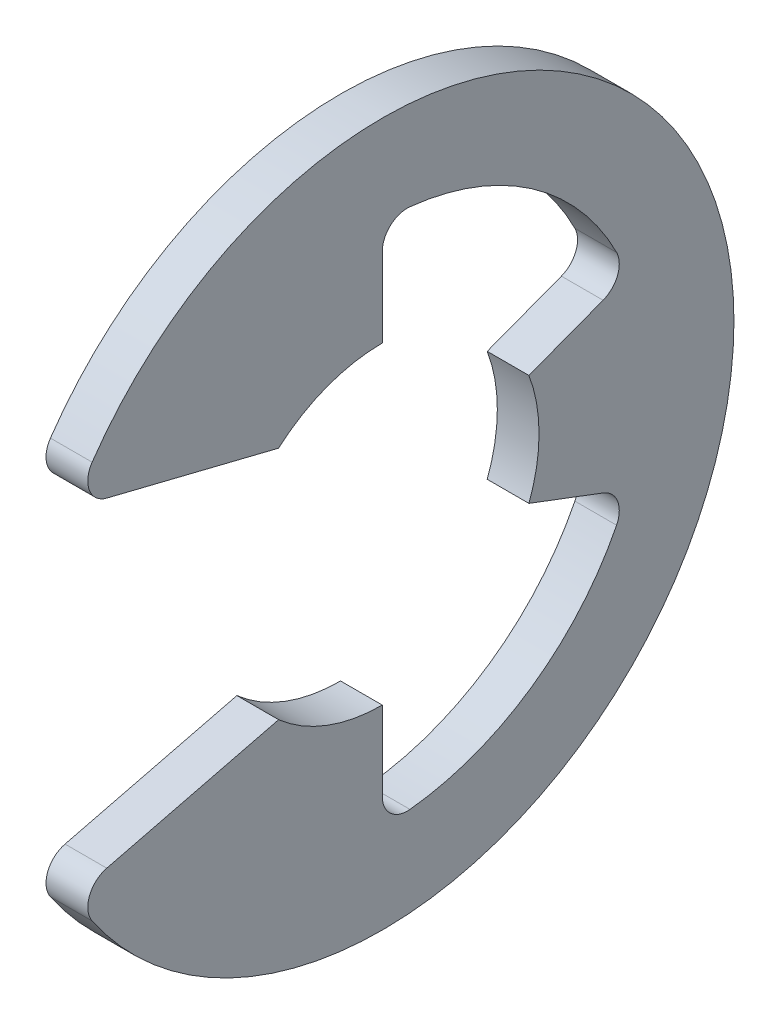
ISO-10303-21;
HEADER;
FILE_DESCRIPTION(('STEP AP214'),'2;1');
FILE_NAME('part.step','',(''),(''),'','','');
FILE_SCHEMA(('AUTOMOTIVE_DESIGN { 1 0 10303 214 1 1 1 1 }'));
ENDSEC;
DATA;
#1=APPLICATION_CONTEXT('core data for automotive mechanical design processes');
#2=APPLICATION_PROTOCOL_DEFINITION('international standard','automotive_design',2000,#1);
#3=PRODUCT_CONTEXT('',#1,'mechanical');
#4=PRODUCT('Part','Part','',(#3));
#5=PRODUCT_RELATED_PRODUCT_CATEGORY('part','',(#4));
#6=PRODUCT_DEFINITION_FORMATION('','',#4);
#7=PRODUCT_DEFINITION_CONTEXT('part definition',#1,'design');
#8=PRODUCT_DEFINITION('design','',#6,#7);
#9=PRODUCT_DEFINITION_SHAPE('','',#8);
#10=(LENGTH_UNIT() NAMED_UNIT(*) SI_UNIT(.MILLI.,.METRE.));
#11=(NAMED_UNIT(*) PLANE_ANGLE_UNIT() SI_UNIT($,.RADIAN.));
#12=(NAMED_UNIT(*) SI_UNIT($,.STERADIAN.) SOLID_ANGLE_UNIT());
#13=UNCERTAINTY_MEASURE_WITH_UNIT(LENGTH_MEASURE(1.E-05),#10,'distance_accuracy_value','');
#14=(GEOMETRIC_REPRESENTATION_CONTEXT(3) GLOBAL_UNCERTAINTY_ASSIGNED_CONTEXT((#13)) GLOBAL_UNIT_ASSIGNED_CONTEXT((#10,
#11,#12)) REPRESENTATION_CONTEXT('',''));
#15=CARTESIAN_POINT('',(0.,0.,0.));
#16=DIRECTION('',(0.,0.,1.));
#17=DIRECTION('',(1.,0.,0.));
#18=AXIS2_PLACEMENT_3D('',#15,#16,#17);
#19=CARTESIAN_POINT('',(0.35,0.,0.));
#20=DIRECTION('',(-1.,0.,0.));
#21=DIRECTION('',(0.,0.,1.));
#22=AXIS2_PLACEMENT_3D('',#19,#20,#21);
#23=CYLINDRICAL_SURFACE('',#22,5.9);
#24=CARTESIAN_POINT('',(0.35,0.,0.));
#25=DIRECTION('',(1.,0.,0.));
#26=DIRECTION('',(0.,0.,-1.));
#27=AXIS2_PLACEMENT_3D('',#24,#25,#26);
#28=CIRCLE('',#27,5.9);
#29=CARTESIAN_POINT('',(0.35,-3.33323303264902,4.86821913537768));
#30=VERTEX_POINT('',#29);
#31=CARTESIAN_POINT('',(0.35,3.33323303264902,4.86821913537768));
#32=VERTEX_POINT('',#31);
#33=EDGE_CURVE('E172',#30,#32,#28,.T.);
#34=ORIENTED_EDGE('',*,*,#33,.F.);
#35=DIRECTION('',(-1.,0.,0.));
#36=VECTOR('',#35,1.);
#37=CARTESIAN_POINT('',(0.35,-3.33323303264902,4.86821913537768));
#38=LINE('',#37,#36);
#39=CARTESIAN_POINT('',(-0.35,-3.33323303264902,4.86821913537768));
#40=VERTEX_POINT('',#39);
#41=EDGE_CURVE('E266',#30,#40,#38,.T.);
#42=ORIENTED_EDGE('',*,*,#41,.T.);
#43=CARTESIAN_POINT('',(-0.35,0.,0.));
#44=DIRECTION('',(1.,0.,0.));
#45=DIRECTION('',(0.,0.,-1.));
#46=AXIS2_PLACEMENT_3D('',#43,#44,#45);
#47=CIRCLE('',#46,5.9);
#48=CARTESIAN_POINT('',(-0.35,3.33323303264902,4.86821913537768));
#49=VERTEX_POINT('',#48);
#50=EDGE_CURVE('E210',#40,#49,#47,.T.);
#51=ORIENTED_EDGE('',*,*,#50,.T.);
#52=DIRECTION('',(-1.,0.,0.));
#53=VECTOR('',#52,1.);
#54=CARTESIAN_POINT('',(0.35,3.33323303264902,4.86821913537768));
#55=LINE('',#54,#53);
#56=EDGE_CURVE('E264',#49,#32,#55,.F.);
#57=ORIENTED_EDGE('',*,*,#56,.T.);
#58=EDGE_LOOP('',(#34,#42,#51,#57));
#59=FACE_BOUND('',#58,.T.);
#60=ADVANCED_FACE('F34',(#59),#23,.T.);
#61=CARTESIAN_POINT('',(0.35,2.82638434535392,5.17895274474852));
#62=DIRECTION('',(0.,0.970536829925373,-0.240952820606873));
#63=DIRECTION('',(0.,0.240952820606873,0.970536829925373));
#64=AXIS2_PLACEMENT_3D('',#61,#62,#63);
#65=PLANE('',#64);
#66=DIRECTION('',(0.,-0.240952820606873,-0.970536829925373));
#67=VECTOR('',#66,1.);
#68=CARTESIAN_POINT('',(0.35,2.82638434535392,5.17895274474852));
#69=LINE('',#68,#67);
#70=CARTESIAN_POINT('',(0.35,2.68832656853585,4.62286812734467));
#71=VERTEX_POINT('',#70);
#72=CARTESIAN_POINT('',(0.35,1.9725,1.73958148702497));
#73=VERTEX_POINT('',#72);
#74=EDGE_CURVE('E158',#71,#73,#69,.T.);
#75=ORIENTED_EDGE('',*,*,#74,.F.);
#76=DIRECTION('',(-1.,0.,0.));
#77=VECTOR('',#76,1.);
#78=CARTESIAN_POINT('',(0.35,2.68832656853585,4.62286812734467));
#79=LINE('',#78,#77);
#80=CARTESIAN_POINT('',(-0.35,2.68832656853585,4.62286812734467));
#81=VERTEX_POINT('',#80);
#82=EDGE_CURVE('E278',#71,#81,#79,.T.);
#83=ORIENTED_EDGE('',*,*,#82,.T.);
#84=DIRECTION('',(0.,-0.240952820606873,-0.970536829925373));
#85=VECTOR('',#84,1.);
#86=CARTESIAN_POINT('',(-0.35,2.82638434535392,5.17895274474852));
#87=LINE('',#86,#85);
#88=CARTESIAN_POINT('',(-0.35,1.9725,1.73958148702497));
#89=VERTEX_POINT('',#88);
#90=EDGE_CURVE('E178',#81,#89,#87,.T.);
#91=ORIENTED_EDGE('',*,*,#90,.T.);
#92=DIRECTION('',(-1.,0.,0.));
#93=VECTOR('',#92,1.);
#94=CARTESIAN_POINT('',(0.35,1.9725,1.73958148702497));
#95=LINE('',#94,#93);
#96=EDGE_CURVE('E175',#73,#89,#95,.T.);
#97=ORIENTED_EDGE('',*,*,#96,.F.);
#98=EDGE_LOOP('',(#75,#83,#91,#97));
#99=FACE_BOUND('',#98,.T.);
#100=ADVANCED_FACE('F176',(#99),#65,.F.);
#101=CARTESIAN_POINT('',(0.35,0.,0.));
#102=DIRECTION('',(-1.,0.,0.));
#103=DIRECTION('',(0.,0.,1.));
#104=AXIS2_PLACEMENT_3D('',#101,#102,#103);
#105=CYLINDRICAL_SURFACE('',#104,2.63);
#106=CARTESIAN_POINT('',(-0.35,0.,0.));
#107=DIRECTION('',(-1.,0.,0.));
#108=DIRECTION('',(0.,0.,1.));
#109=AXIS2_PLACEMENT_3D('',#106,#107,#108);
#110=CIRCLE('',#109,2.63);
#111=CARTESIAN_POINT('',(-0.35,2.63,0.));
#112=VERTEX_POINT('',#111);
#113=EDGE_CURVE('E214',#89,#112,#110,.T.);
#114=ORIENTED_EDGE('',*,*,#113,.T.);
#115=DIRECTION('',(-1.,0.,0.));
#116=VECTOR('',#115,1.);
#117=CARTESIAN_POINT('',(0.35,2.63,0.));
#118=LINE('',#117,#116);
#119=CARTESIAN_POINT('',(0.35,2.63,0.));
#120=VERTEX_POINT('',#119);
#121=EDGE_CURVE('E182',#120,#112,#118,.T.);
#122=ORIENTED_EDGE('',*,*,#121,.F.);
#123=CARTESIAN_POINT('',(0.35,0.,0.));
#124=DIRECTION('',(-1.,0.,0.));
#125=DIRECTION('',(0.,0.,1.));
#126=AXIS2_PLACEMENT_3D('',#123,#124,#125);
#127=CIRCLE('',#126,2.63);
#128=EDGE_CURVE('E164',#73,#120,#127,.T.);
#129=ORIENTED_EDGE('',*,*,#128,.F.);
#130=ORIENTED_EDGE('',*,*,#96,.T.);
#131=EDGE_LOOP('',(#114,#122,#129,#130));
#132=FACE_BOUND('',#131,.T.);
#133=ADVANCED_FACE('F184',(#132),#105,.F.);
#134=CARTESIAN_POINT('',(0.35,2.63,0.));
#135=DIRECTION('',(0.,0.,1.));
#136=DIRECTION('',(0.,-1.,0.));
#137=AXIS2_PLACEMENT_3D('',#134,#135,#136);
#138=PLANE('',#137);
#139=DIRECTION('',(0.,1.,0.));
#140=VECTOR('',#139,1.);
#141=CARTESIAN_POINT('',(-0.35,2.63,0.));
#142=LINE('',#141,#140);
#143=CARTESIAN_POINT('',(-0.35,3.96037227987639,0.));
#144=VERTEX_POINT('',#143);
#145=EDGE_CURVE('E216',#112,#144,#142,.T.);
#146=ORIENTED_EDGE('',*,*,#145,.T.);
#147=DIRECTION('',(1.,0.,0.));
#148=VECTOR('',#147,1.);
#149=CARTESIAN_POINT('',(0.35,3.96037227987639,0.));
#150=LINE('',#149,#148);
#151=CARTESIAN_POINT('',(0.35,3.96037227987639,0.));
#152=VERTEX_POINT('',#151);
#153=EDGE_CURVE('E262',#144,#152,#150,.T.);
#154=ORIENTED_EDGE('',*,*,#153,.T.);
#155=DIRECTION('',(0.,1.,0.));
#156=VECTOR('',#155,1.);
#157=CARTESIAN_POINT('',(0.35,2.63,0.));
#158=LINE('',#157,#156);
#159=EDGE_CURVE('E187',#120,#152,#158,.T.);
#160=ORIENTED_EDGE('',*,*,#159,.F.);
#161=ORIENTED_EDGE('',*,*,#121,.T.);
#162=EDGE_LOOP('',(#146,#154,#160,#161));
#163=FACE_BOUND('',#162,.T.);
#164=ADVANCED_FACE('F384',(#163),#138,.F.);
#165=CARTESIAN_POINT('',(0.35,0.,0.));
#166=DIRECTION('',(-1.,0.,0.));
#167=DIRECTION('',(0.,0.,1.));
#168=AXIS2_PLACEMENT_3D('',#165,#166,#167);
#169=CYLINDRICAL_SURFACE('',#168,4.40258064516129);
#170=CARTESIAN_POINT('',(0.35,0.,0.));
#171=DIRECTION('',(-1.,0.,0.));
#172=DIRECTION('',(0.,0.,-1.));
#173=AXIS2_PLACEMENT_3D('',#170,#171,#172);
#174=CIRCLE('',#173,4.40258064516129);
#175=CARTESIAN_POINT('',(0.35,4.37803020215074,-0.4642928883849));
#176=VERTEX_POINT('',#175);
#177=CARTESIAN_POINT('',(0.35,1.98217365095315,-3.93111993643235));
#178=VERTEX_POINT('',#177);
#179=EDGE_CURVE('E189',#176,#178,#174,.T.);
#180=ORIENTED_EDGE('',*,*,#179,.F.);
#181=DIRECTION('',(-1.,0.,0.));
#182=VECTOR('',#181,1.);
#183=CARTESIAN_POINT('',(0.35,4.37803020215074,-0.4642928883849));
#184=LINE('',#183,#182);
#185=CARTESIAN_POINT('',(-0.35,4.37803020215074,-0.4642928883849));
#186=VERTEX_POINT('',#185);
#187=EDGE_CURVE('E259',#176,#186,#184,.T.);
#188=ORIENTED_EDGE('',*,*,#187,.T.);
#189=CARTESIAN_POINT('',(-0.35,0.,0.));
#190=DIRECTION('',(-1.,0.,0.));
#191=DIRECTION('',(0.,0.,-1.));
#192=AXIS2_PLACEMENT_3D('',#189,#190,#191);
#193=CIRCLE('',#192,4.40258064516129);
#194=CARTESIAN_POINT('',(-0.35,1.98217365095315,-3.93111993643235));
#195=VERTEX_POINT('',#194);
#196=EDGE_CURVE('E219',#186,#195,#193,.T.);
#197=ORIENTED_EDGE('',*,*,#196,.T.);
#198=DIRECTION('',(-1.,0.,0.));
#199=VECTOR('',#198,1.);
#200=CARTESIAN_POINT('',(0.35,1.98217365095315,-3.93111993643235));
#201=LINE('',#200,#199);
#202=EDGE_CURVE('E257',#195,#178,#201,.F.);
#203=ORIENTED_EDGE('',*,*,#202,.T.);
#204=EDGE_LOOP('',(#180,#188,#197,#203));
#205=FACE_BOUND('',#204,.T.);
#206=ADVANCED_FACE('F306',(#205),#169,.F.);
#207=CARTESIAN_POINT('',(0.35,0.92984541726031,-2.46013973180387));
#208=DIRECTION('',(0.,-0.935414346693484,-0.353553390593276));
#209=DIRECTION('',(0.,0.353553390593276,-0.935414346693485));
#210=AXIS2_PLACEMENT_3D('',#207,#208,#209);
#211=PLANE('',#210);
#212=DIRECTION('',(0.,-0.353553390593276,0.935414346693484));
#213=VECTOR('',#212,1.);
#214=CARTESIAN_POINT('',(0.35,0.92984541726031,-2.46013973180387));
#215=LINE('',#214,#213);
#216=CARTESIAN_POINT('',(0.35,1.40020304756192,-3.70458904884356));
#217=VERTEX_POINT('',#216);
#218=CARTESIAN_POINT('',(0.35,0.92984541726031,-2.46013973180387));
#219=VERTEX_POINT('',#218);
#220=EDGE_CURVE('E194',#217,#219,#215,.T.);
#221=ORIENTED_EDGE('',*,*,#220,.F.);
#222=DIRECTION('',(1.,0.,0.));
#223=VECTOR('',#222,1.);
#224=CARTESIAN_POINT('',(-0.35,1.40020304756192,-3.70458904884356));
#225=LINE('',#224,#223);
#226=CARTESIAN_POINT('',(-0.35,1.40020304756192,-3.70458904884356));
#227=VERTEX_POINT('',#226);
#228=EDGE_CURVE('E281',#217,#227,#225,.F.);
#229=ORIENTED_EDGE('',*,*,#228,.T.);
#230=DIRECTION('',(0.,-0.353553390593276,0.935414346693484));
#231=VECTOR('',#230,1.);
#232=CARTESIAN_POINT('',(-0.35,0.92984541726031,-2.46013973180387));
#233=LINE('',#232,#231);
#234=CARTESIAN_POINT('',(-0.35,0.92984541726031,-2.46013973180387));
#235=VERTEX_POINT('',#234);
#236=EDGE_CURVE('E222',#227,#235,#233,.T.);
#237=ORIENTED_EDGE('',*,*,#236,.T.);
#238=DIRECTION('',(-1.,0.,0.));
#239=VECTOR('',#238,1.);
#240=CARTESIAN_POINT('',(0.35,0.92984541726031,-2.46013973180387));
#241=LINE('',#240,#239);
#242=EDGE_CURVE('E246',#219,#235,#241,.T.);
#243=ORIENTED_EDGE('',*,*,#242,.F.);
#244=EDGE_LOOP('',(#221,#229,#237,#243));
#245=FACE_BOUND('',#244,.T.);
#246=ADVANCED_FACE('F309',(#245),#211,.F.);
#247=CARTESIAN_POINT('',(0.35,0.,0.));
#248=DIRECTION('',(-1.,0.,0.));
#249=DIRECTION('',(0.,0.,1.));
#250=AXIS2_PLACEMENT_3D('',#247,#248,#249);
#251=CYLINDRICAL_SURFACE('',#250,2.63);
#252=CARTESIAN_POINT('',(-0.35,0.,0.));
#253=DIRECTION('',(-1.,0.,0.));
#254=DIRECTION('',(0.,0.,1.));
#255=AXIS2_PLACEMENT_3D('',#252,#253,#254);
#256=CIRCLE('',#255,2.63);
#257=CARTESIAN_POINT('',(-0.35,-0.92984541726031,-2.46013973180387));
#258=VERTEX_POINT('',#257);
#259=EDGE_CURVE('E224',#235,#258,#256,.T.);
#260=ORIENTED_EDGE('',*,*,#259,.T.);
#261=DIRECTION('',(-1.,0.,0.));
#262=VECTOR('',#261,1.);
#263=CARTESIAN_POINT('',(0.35,-0.92984541726031,-2.46013973180387));
#264=LINE('',#263,#262);
#265=CARTESIAN_POINT('',(0.35,-0.92984541726031,-2.46013973180387));
#266=VERTEX_POINT('',#265);
#267=EDGE_CURVE('E243',#266,#258,#264,.T.);
#268=ORIENTED_EDGE('',*,*,#267,.F.);
#269=CARTESIAN_POINT('',(0.35,0.,0.));
#270=DIRECTION('',(-1.,0.,0.));
#271=DIRECTION('',(0.,0.,1.));
#272=AXIS2_PLACEMENT_3D('',#269,#270,#271);
#273=CIRCLE('',#272,2.63);
#274=EDGE_CURVE('E196',#219,#266,#273,.T.);
#275=ORIENTED_EDGE('',*,*,#274,.F.);
#276=ORIENTED_EDGE('',*,*,#242,.T.);
#277=EDGE_LOOP('',(#260,#268,#275,#276));
#278=FACE_BOUND('',#277,.T.);
#279=ADVANCED_FACE('F315',(#278),#251,.F.);
#280=CARTESIAN_POINT('',(0.35,-0.92984541726031,-2.46013973180387));
#281=DIRECTION('',(0.,0.935414346693485,-0.353553390593276));
#282=DIRECTION('',(0.,0.353553390593276,0.935414346693485));
#283=AXIS2_PLACEMENT_3D('',#280,#281,#282);
#284=PLANE('',#283);
#285=DIRECTION('',(0.,-0.353553390593276,-0.935414346693485));
#286=VECTOR('',#285,1.);
#287=CARTESIAN_POINT('',(-0.35,-0.92984541726031,-2.46013973180387));
#288=LINE('',#287,#286);
#289=CARTESIAN_POINT('',(-0.35,-1.40020304756192,-3.70458904884357));
#290=VERTEX_POINT('',#289);
#291=EDGE_CURVE('E226',#258,#290,#288,.T.);
#292=ORIENTED_EDGE('',*,*,#291,.T.);
#293=DIRECTION('',(1.,0.,0.));
#294=VECTOR('',#293,1.);
#295=CARTESIAN_POINT('',(0.35,-1.40020304756191,-3.70458904884357));
#296=LINE('',#295,#294);
#297=CARTESIAN_POINT('',(0.35,-1.40020304756192,-3.70458904884357));
#298=VERTEX_POINT('',#297);
#299=EDGE_CURVE('E49',#290,#298,#296,.T.);
#300=ORIENTED_EDGE('',*,*,#299,.T.);
#301=DIRECTION('',(0.,-0.353553390593276,-0.935414346693485));
#302=VECTOR('',#301,1.);
#303=CARTESIAN_POINT('',(0.35,-0.92984541726031,-2.46013973180387));
#304=LINE('',#303,#302);
#305=EDGE_CURVE('E198',#266,#298,#304,.T.);
#306=ORIENTED_EDGE('',*,*,#305,.F.);
#307=ORIENTED_EDGE('',*,*,#267,.T.);
#308=EDGE_LOOP('',(#292,#300,#306,#307));
#309=FACE_BOUND('',#308,.T.);
#310=ADVANCED_FACE('F317',(#309),#284,.F.);
#311=CARTESIAN_POINT('',(0.35,0.,0.));
#312=DIRECTION('',(-1.,0.,0.));
#313=DIRECTION('',(0.,0.,1.));
#314=AXIS2_PLACEMENT_3D('',#311,#312,#313);
#315=CYLINDRICAL_SURFACE('',#314,4.40258064516129);
#316=CARTESIAN_POINT('',(-0.35,0.,0.));
#317=DIRECTION('',(-1.,0.,0.));
#318=DIRECTION('',(0.,0.,-1.));
#319=AXIS2_PLACEMENT_3D('',#316,#317,#318);
#320=CIRCLE('',#319,4.40258064516129);
#321=CARTESIAN_POINT('',(-0.35,-1.98217365095315,-3.93111993643235));
#322=VERTEX_POINT('',#321);
#323=CARTESIAN_POINT('',(-0.35,-4.37803020215074,-0.464292888384901));
#324=VERTEX_POINT('',#323);
#325=EDGE_CURVE('E228',#322,#324,#320,.T.);
#326=ORIENTED_EDGE('',*,*,#325,.T.);
#327=DIRECTION('',(-1.,0.,0.));
#328=VECTOR('',#327,1.);
#329=CARTESIAN_POINT('',(0.35,-4.37803020215074,-0.464292888384901));
#330=LINE('',#329,#328);
#331=CARTESIAN_POINT('',(0.35,-4.37803020215074,-0.464292888384901));
#332=VERTEX_POINT('',#331);
#333=EDGE_CURVE('E255',#324,#332,#330,.F.);
#334=ORIENTED_EDGE('',*,*,#333,.T.);
#335=CARTESIAN_POINT('',(0.35,0.,0.));
#336=DIRECTION('',(-1.,0.,0.));
#337=DIRECTION('',(0.,0.,-1.));
#338=AXIS2_PLACEMENT_3D('',#335,#336,#337);
#339=CIRCLE('',#338,4.40258064516129);
#340=CARTESIAN_POINT('',(0.35,-1.98217365095315,-3.93111993643235));
#341=VERTEX_POINT('',#340);
#342=EDGE_CURVE('E200',#341,#332,#339,.T.);
#343=ORIENTED_EDGE('',*,*,#342,.F.);
#344=DIRECTION('',(-1.,0.,0.));
#345=VECTOR('',#344,1.);
#346=CARTESIAN_POINT('',(0.35,-1.98217365095315,-3.93111993643235));
#347=LINE('',#346,#345);
#348=EDGE_CURVE('E252',#341,#322,#347,.T.);
#349=ORIENTED_EDGE('',*,*,#348,.T.);
#350=EDGE_LOOP('',(#326,#334,#343,#349));
#351=FACE_BOUND('',#350,.T.);
#352=ADVANCED_FACE('F319',(#351),#315,.F.);
#353=CARTESIAN_POINT('',(0.35,-2.63,0.));
#354=DIRECTION('',(0.,0.,1.));
#355=DIRECTION('',(0.,-1.,0.));
#356=AXIS2_PLACEMENT_3D('',#353,#354,#355);
#357=PLANE('',#356);
#358=DIRECTION('',(0.,1.,0.));
#359=VECTOR('',#358,1.);
#360=CARTESIAN_POINT('',(0.35,-2.63,0.));
#361=LINE('',#360,#359);
#362=CARTESIAN_POINT('',(0.35,-3.96037227987639,0.));
#363=VERTEX_POINT('',#362);
#364=CARTESIAN_POINT('',(0.35,-2.63,0.));
#365=VERTEX_POINT('',#364);
#366=EDGE_CURVE('E203',#363,#365,#361,.T.);
#367=ORIENTED_EDGE('',*,*,#366,.F.);
#368=DIRECTION('',(1.,0.,0.));
#369=VECTOR('',#368,1.);
#370=CARTESIAN_POINT('',(-0.35,-3.96037227987639,0.));
#371=LINE('',#370,#369);
#372=CARTESIAN_POINT('',(-0.35,-3.96037227987639,0.));
#373=VERTEX_POINT('',#372);
#374=EDGE_CURVE('E181',#363,#373,#371,.F.);
#375=ORIENTED_EDGE('',*,*,#374,.T.);
#376=DIRECTION('',(0.,1.,0.));
#377=VECTOR('',#376,1.);
#378=CARTESIAN_POINT('',(-0.35,-2.63,0.));
#379=LINE('',#378,#377);
#380=CARTESIAN_POINT('',(-0.35,-2.63,0.));
#381=VERTEX_POINT('',#380);
#382=EDGE_CURVE('E231',#373,#381,#379,.T.);
#383=ORIENTED_EDGE('',*,*,#382,.T.);
#384=DIRECTION('',(-1.,0.,0.));
#385=VECTOR('',#384,1.);
#386=CARTESIAN_POINT('',(0.35,-2.63,0.));
#387=LINE('',#386,#385);
#388=EDGE_CURVE('E240',#365,#381,#387,.T.);
#389=ORIENTED_EDGE('',*,*,#388,.F.);
#390=EDGE_LOOP('',(#367,#375,#383,#389));
#391=FACE_BOUND('',#390,.T.);
#392=ADVANCED_FACE('F325',(#391),#357,.F.);
#393=CARTESIAN_POINT('',(0.35,0.,0.));
#394=DIRECTION('',(-1.,0.,0.));
#395=DIRECTION('',(0.,0.,1.));
#396=AXIS2_PLACEMENT_3D('',#393,#394,#395);
#397=CYLINDRICAL_SURFACE('',#396,2.63);
#398=CARTESIAN_POINT('',(-0.35,0.,0.));
#399=DIRECTION('',(-1.,0.,0.));
#400=DIRECTION('',(0.,0.,-1.));
#401=AXIS2_PLACEMENT_3D('',#398,#399,#400);
#402=CIRCLE('',#401,2.63);
#403=CARTESIAN_POINT('',(-0.35,-1.9725,1.73958148702497));
#404=VERTEX_POINT('',#403);
#405=EDGE_CURVE('E233',#381,#404,#402,.T.);
#406=ORIENTED_EDGE('',*,*,#405,.T.);
#407=DIRECTION('',(-1.,0.,0.));
#408=VECTOR('',#407,1.);
#409=CARTESIAN_POINT('',(0.35,-1.9725,1.73958148702497));
#410=LINE('',#409,#408);
#411=CARTESIAN_POINT('',(0.35,-1.9725,1.73958148702497));
#412=VERTEX_POINT('',#411);
#413=EDGE_CURVE('E209',#412,#404,#410,.T.);
#414=ORIENTED_EDGE('',*,*,#413,.F.);
#415=CARTESIAN_POINT('',(0.35,0.,0.));
#416=DIRECTION('',(-1.,0.,0.));
#417=DIRECTION('',(0.,0.,-1.));
#418=AXIS2_PLACEMENT_3D('',#415,#416,#417);
#419=CIRCLE('',#418,2.63);
#420=EDGE_CURVE('E205',#365,#412,#419,.T.);
#421=ORIENTED_EDGE('',*,*,#420,.F.);
#422=ORIENTED_EDGE('',*,*,#388,.T.);
#423=EDGE_LOOP('',(#406,#414,#421,#422));
#424=FACE_BOUND('',#423,.T.);
#425=ADVANCED_FACE('F374',(#424),#397,.F.);
#426=CARTESIAN_POINT('',(0.35,-2.82638434535392,5.17895274474852));
#427=DIRECTION('',(0.,-0.970536829925373,-0.240952820606873));
#428=DIRECTION('',(0.,0.240952820606873,-0.970536829925373));
#429=AXIS2_PLACEMENT_3D('',#426,#427,#428);
#430=PLANE('',#429);
#431=DIRECTION('',(0.,-0.240952820606873,0.970536829925373));
#432=VECTOR('',#431,1.);
#433=CARTESIAN_POINT('',(-0.35,-2.82638434535392,5.17895274474852));
#434=LINE('',#433,#432);
#435=CARTESIAN_POINT('',(-0.35,-2.68832656853585,4.62286812734467));
#436=VERTEX_POINT('',#435);
#437=EDGE_CURVE('E235',#404,#436,#434,.T.);
#438=ORIENTED_EDGE('',*,*,#437,.T.);
#439=DIRECTION('',(-1.,0.,0.));
#440=VECTOR('',#439,1.);
#441=CARTESIAN_POINT('',(0.35,-2.68832656853585,4.62286812734467));
#442=LINE('',#441,#440);
#443=CARTESIAN_POINT('',(0.35,-2.68832656853585,4.62286812734467));
#444=VERTEX_POINT('',#443);
#445=EDGE_CURVE('E273',#436,#444,#442,.F.);
#446=ORIENTED_EDGE('',*,*,#445,.T.);
#447=DIRECTION('',(0.,-0.240952820606873,0.970536829925373));
#448=VECTOR('',#447,1.);
#449=CARTESIAN_POINT('',(0.35,-2.82638434535392,5.17895274474852));
#450=LINE('',#449,#448);
#451=EDGE_CURVE('E207',#412,#444,#450,.T.);
#452=ORIENTED_EDGE('',*,*,#451,.F.);
#453=ORIENTED_EDGE('',*,*,#413,.T.);
#454=EDGE_LOOP('',(#438,#446,#452,#453));
#455=FACE_BOUND('',#454,.T.);
#456=ADVANCED_FACE('F416',(#455),#430,.F.);
#457=CARTESIAN_POINT('',(0.35,0.,0.));
#458=DIRECTION('',(1.,0.,0.));
#459=DIRECTION('',(0.,0.,-1.));
#460=AXIS2_PLACEMENT_3D('',#457,#458,#459);
#461=PLANE('',#460);
#462=ORIENTED_EDGE('',*,*,#451,.T.);
#463=CARTESIAN_POINT('',(0.35,-3.09595203710451,4.52166794268978));
#464=DIRECTION('',(1.,0.,0.));
#465=DIRECTION('',(0.,0.,-1.));
#466=AXIS2_PLACEMENT_3D('',#463,#464,#465);
#467=CIRCLE('',#466,0.42);
#468=EDGE_CURVE('E276',#444,#30,#467,.T.);
#469=ORIENTED_EDGE('',*,*,#468,.T.);
#470=ORIENTED_EDGE('',*,*,#33,.T.);
#471=CARTESIAN_POINT('',(0.35,3.09595203710451,4.52166794268978));
#472=DIRECTION('',(1.,0.,0.));
#473=DIRECTION('',(0.,0.,-1.));
#474=AXIS2_PLACEMENT_3D('',#471,#472,#473);
#475=CIRCLE('',#474,0.42);
#476=EDGE_CURVE('E168',#32,#71,#475,.T.);
#477=ORIENTED_EDGE('',*,*,#476,.T.);
#478=ORIENTED_EDGE('',*,*,#74,.T.);
#479=ORIENTED_EDGE('',*,*,#128,.T.);
#480=ORIENTED_EDGE('',*,*,#159,.T.);
#481=CARTESIAN_POINT('',(0.35,3.96037227987639,-0.419999999999998));
#482=DIRECTION('',(1.,0.,0.));
#483=DIRECTION('',(0.,0.,-1.));
#484=AXIS2_PLACEMENT_3D('',#481,#482,#483);
#485=CIRCLE('',#484,0.42);
#486=EDGE_CURVE('E290',#152,#176,#485,.F.);
#487=ORIENTED_EDGE('',*,*,#486,.T.);
#488=ORIENTED_EDGE('',*,*,#179,.T.);
#489=CARTESIAN_POINT('',(0.35,1.79307707317318,-3.55609662479439));
#490=DIRECTION('',(1.,0.,0.));
#491=DIRECTION('',(0.,0.,-1.));
#492=AXIS2_PLACEMENT_3D('',#489,#490,#491);
#493=CIRCLE('',#492,0.42);
#494=EDGE_CURVE('E11',#178,#217,#493,.F.);
#495=ORIENTED_EDGE('',*,*,#494,.T.);
#496=ORIENTED_EDGE('',*,*,#220,.T.);
#497=ORIENTED_EDGE('',*,*,#274,.T.);
#498=ORIENTED_EDGE('',*,*,#305,.T.);
#499=CARTESIAN_POINT('',(0.35,-1.79307707317318,-3.55609662479439));
#500=DIRECTION('',(1.,0.,0.));
#501=DIRECTION('',(0.,0.,-1.));
#502=AXIS2_PLACEMENT_3D('',#499,#500,#501);
#503=CIRCLE('',#502,0.42);
#504=EDGE_CURVE('E294',#298,#341,#503,.F.);
#505=ORIENTED_EDGE('',*,*,#504,.T.);
#506=ORIENTED_EDGE('',*,*,#342,.T.);
#507=CARTESIAN_POINT('',(0.35,-3.96037227987639,-0.419999999999999));
#508=DIRECTION('',(1.,0.,0.));
#509=DIRECTION('',(0.,0.,-1.));
#510=AXIS2_PLACEMENT_3D('',#507,#508,#509);
#511=CIRCLE('',#510,0.42);
#512=EDGE_CURVE('E286',#332,#363,#511,.F.);
#513=ORIENTED_EDGE('',*,*,#512,.T.);
#514=ORIENTED_EDGE('',*,*,#366,.T.);
#515=ORIENTED_EDGE('',*,*,#420,.T.);
#516=EDGE_LOOP('',(#462,#469,#470,#477,#478,#479,#480,#487,#488,#495,#496,#497,#498,#505,#506,
#513,#514,#515));
#517=FACE_BOUND('',#516,.T.);
#518=ADVANCED_FACE('F161',(#517),#461,.T.);
#519=CARTESIAN_POINT('',(-0.35,0.,0.));
#520=DIRECTION('',(1.,0.,0.));
#521=DIRECTION('',(0.,0.,-1.));
#522=AXIS2_PLACEMENT_3D('',#519,#520,#521);
#523=PLANE('',#522);
#524=ORIENTED_EDGE('',*,*,#50,.F.);
#525=CARTESIAN_POINT('',(-0.35,-3.09595203710451,4.52166794268978));
#526=DIRECTION('',(1.,0.,0.));
#527=DIRECTION('',(0.,0.,-1.));
#528=AXIS2_PLACEMENT_3D('',#525,#526,#527);
#529=CIRCLE('',#528,0.42);
#530=EDGE_CURVE('E271',#40,#436,#529,.F.);
#531=ORIENTED_EDGE('',*,*,#530,.T.);
#532=ORIENTED_EDGE('',*,*,#437,.F.);
#533=ORIENTED_EDGE('',*,*,#405,.F.);
#534=ORIENTED_EDGE('',*,*,#382,.F.);
#535=CARTESIAN_POINT('',(-0.35,-3.96037227987639,-0.419999999999999));
#536=DIRECTION('',(1.,0.,0.));
#537=DIRECTION('',(0.,0.,-1.));
#538=AXIS2_PLACEMENT_3D('',#535,#536,#537);
#539=CIRCLE('',#538,0.42);
#540=EDGE_CURVE('E284',#373,#324,#539,.T.);
#541=ORIENTED_EDGE('',*,*,#540,.T.);
#542=ORIENTED_EDGE('',*,*,#325,.F.);
#543=CARTESIAN_POINT('',(-0.35,-1.79307707317318,-3.55609662479439));
#544=DIRECTION('',(1.,0.,0.));
#545=DIRECTION('',(0.,0.,-1.));
#546=AXIS2_PLACEMENT_3D('',#543,#544,#545);
#547=CIRCLE('',#546,0.42);
#548=EDGE_CURVE('E292',#322,#290,#547,.T.);
#549=ORIENTED_EDGE('',*,*,#548,.T.);
#550=ORIENTED_EDGE('',*,*,#291,.F.);
#551=ORIENTED_EDGE('',*,*,#259,.F.);
#552=ORIENTED_EDGE('',*,*,#236,.F.);
#553=CARTESIAN_POINT('',(-0.35,1.79307707317318,-3.55609662479439));
#554=DIRECTION('',(1.,0.,0.));
#555=DIRECTION('',(0.,0.,-1.));
#556=AXIS2_PLACEMENT_3D('',#553,#554,#555);
#557=CIRCLE('',#556,0.42);
#558=EDGE_CURVE('E42',#227,#195,#557,.T.);
#559=ORIENTED_EDGE('',*,*,#558,.T.);
#560=ORIENTED_EDGE('',*,*,#196,.F.);
#561=CARTESIAN_POINT('',(-0.35,3.96037227987639,-0.419999999999998));
#562=DIRECTION('',(1.,0.,0.));
#563=DIRECTION('',(0.,0.,-1.));
#564=AXIS2_PLACEMENT_3D('',#561,#562,#563);
#565=CIRCLE('',#564,0.42);
#566=EDGE_CURVE('E288',#186,#144,#565,.T.);
#567=ORIENTED_EDGE('',*,*,#566,.T.);
#568=ORIENTED_EDGE('',*,*,#145,.F.);
#569=ORIENTED_EDGE('',*,*,#113,.F.);
#570=ORIENTED_EDGE('',*,*,#90,.F.);
#571=CARTESIAN_POINT('',(-0.35,3.09595203710451,4.52166794268978));
#572=DIRECTION('',(1.,0.,0.));
#573=DIRECTION('',(0.,0.,-1.));
#574=AXIS2_PLACEMENT_3D('',#571,#572,#573);
#575=CIRCLE('',#574,0.42);
#576=EDGE_CURVE('E269',#81,#49,#575,.F.);
#577=ORIENTED_EDGE('',*,*,#576,.T.);
#578=EDGE_LOOP('',(#524,#531,#532,#533,#534,#541,#542,#549,#550,#551,#552,#559,#560,#567,#568,
#569,#570,#577));
#579=FACE_BOUND('',#578,.T.);
#580=ADVANCED_FACE('F299',(#579),#523,.F.);
#581=CARTESIAN_POINT('',(0.35,-3.96037227987639,-0.419999999999999));
#582=DIRECTION('',(-1.,0.,0.));
#583=DIRECTION('',(0.,0.,1.));
#584=AXIS2_PLACEMENT_3D('',#581,#582,#583);
#585=CYLINDRICAL_SURFACE('',#584,0.42);
#586=ORIENTED_EDGE('',*,*,#512,.F.);
#587=ORIENTED_EDGE('',*,*,#333,.F.);
#588=ORIENTED_EDGE('',*,*,#540,.F.);
#589=ORIENTED_EDGE('',*,*,#374,.F.);
#590=EDGE_LOOP('',(#586,#587,#588,#589));
#591=FACE_BOUND('',#590,.T.);
#592=ADVANCED_FACE('F339',(#591),#585,.F.);
#593=CARTESIAN_POINT('',(0.35,3.96037227987639,-0.419999999999998));
#594=DIRECTION('',(-1.,0.,0.));
#595=DIRECTION('',(0.,0.,1.));
#596=AXIS2_PLACEMENT_3D('',#593,#594,#595);
#597=CYLINDRICAL_SURFACE('',#596,0.42);
#598=ORIENTED_EDGE('',*,*,#486,.F.);
#599=ORIENTED_EDGE('',*,*,#153,.F.);
#600=ORIENTED_EDGE('',*,*,#566,.F.);
#601=ORIENTED_EDGE('',*,*,#187,.F.);
#602=EDGE_LOOP('',(#598,#599,#600,#601));
#603=FACE_BOUND('',#602,.T.);
#604=ADVANCED_FACE('F342',(#603),#597,.F.);
#605=CARTESIAN_POINT('',(0.35,-3.09595203710451,4.52166794268978));
#606=DIRECTION('',(-1.,0.,0.));
#607=DIRECTION('',(0.,0.,1.));
#608=AXIS2_PLACEMENT_3D('',#605,#606,#607);
#609=CYLINDRICAL_SURFACE('',#608,0.42);
#610=ORIENTED_EDGE('',*,*,#468,.F.);
#611=ORIENTED_EDGE('',*,*,#445,.F.);
#612=ORIENTED_EDGE('',*,*,#530,.F.);
#613=ORIENTED_EDGE('',*,*,#41,.F.);
#614=EDGE_LOOP('',(#610,#611,#612,#613));
#615=FACE_BOUND('',#614,.T.);
#616=ADVANCED_FACE('F346',(#615),#609,.T.);
#617=CARTESIAN_POINT('',(0.35,3.09595203710451,4.52166794268978));
#618=DIRECTION('',(-1.,0.,0.));
#619=DIRECTION('',(0.,0.,1.));
#620=AXIS2_PLACEMENT_3D('',#617,#618,#619);
#621=CYLINDRICAL_SURFACE('',#620,0.42);
#622=ORIENTED_EDGE('',*,*,#476,.F.);
#623=ORIENTED_EDGE('',*,*,#56,.F.);
#624=ORIENTED_EDGE('',*,*,#576,.F.);
#625=ORIENTED_EDGE('',*,*,#82,.F.);
#626=EDGE_LOOP('',(#622,#623,#624,#625));
#627=FACE_BOUND('',#626,.T.);
#628=ADVANCED_FACE('F350',(#627),#621,.T.);
#629=CARTESIAN_POINT('',(0.35,-1.79307707317318,-3.55609662479439));
#630=DIRECTION('',(-1.,0.,0.));
#631=DIRECTION('',(0.,0.,1.));
#632=AXIS2_PLACEMENT_3D('',#629,#630,#631);
#633=CYLINDRICAL_SURFACE('',#632,0.42);
#634=ORIENTED_EDGE('',*,*,#504,.F.);
#635=ORIENTED_EDGE('',*,*,#299,.F.);
#636=ORIENTED_EDGE('',*,*,#548,.F.);
#637=ORIENTED_EDGE('',*,*,#348,.F.);
#638=EDGE_LOOP('',(#634,#635,#636,#637));
#639=FACE_BOUND('',#638,.T.);
#640=ADVANCED_FACE('F353',(#639),#633,.F.);
#641=CARTESIAN_POINT('',(0.35,1.79307707317318,-3.55609662479439));
#642=DIRECTION('',(-1.,0.,0.));
#643=DIRECTION('',(0.,0.,1.));
#644=AXIS2_PLACEMENT_3D('',#641,#642,#643);
#645=CYLINDRICAL_SURFACE('',#644,0.42);
#646=ORIENTED_EDGE('',*,*,#494,.F.);
#647=ORIENTED_EDGE('',*,*,#202,.F.);
#648=ORIENTED_EDGE('',*,*,#558,.F.);
#649=ORIENTED_EDGE('',*,*,#228,.F.);
#650=EDGE_LOOP('',(#646,#647,#648,#649));
#651=FACE_BOUND('',#650,.T.);
#652=ADVANCED_FACE('F36',(#651),#645,.F.);
#653=CLOSED_SHELL('',(#60,#100,#133,#164,#206,#246,#279,#310,#352,#392,#425,#456,#518,#580,#592,
#604,#616,#628,#640,#652));
#654=MANIFOLD_SOLID_BREP('B2',#653);
#655=ADVANCED_BREP_SHAPE_REPRESENTATION('',(#18,#654),#14);
#656=SHAPE_DEFINITION_REPRESENTATION(#9,#655);
ENDSEC;
END-ISO-10303-21;
